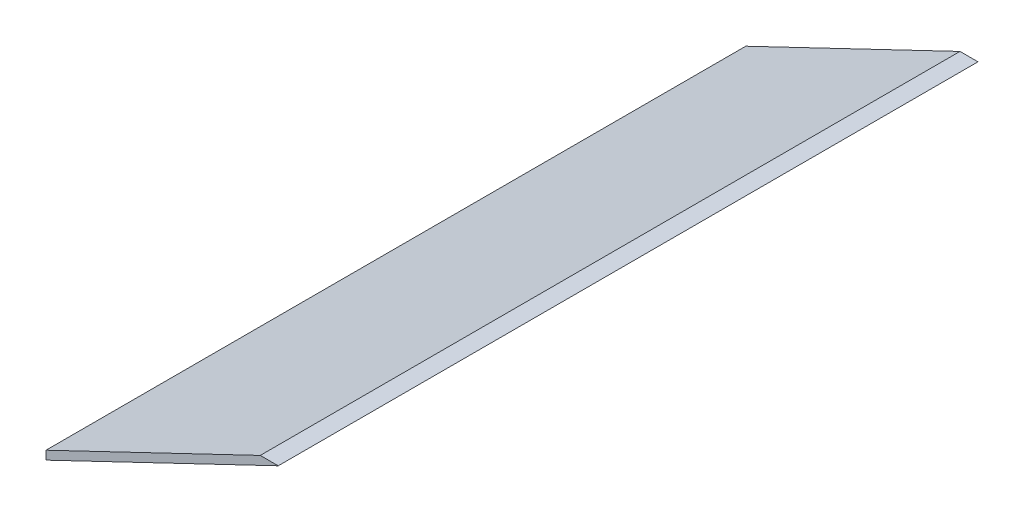
ISO-10303-21;
HEADER;
FILE_DESCRIPTION(('STEP AP214'),'2;1');
FILE_NAME('part.step','',(''),(''),'','','');
FILE_SCHEMA(('AUTOMOTIVE_DESIGN { 1 0 10303 214 1 1 1 1 }'));
ENDSEC;
DATA;
#1=APPLICATION_CONTEXT('core data for automotive mechanical design processes');
#2=APPLICATION_PROTOCOL_DEFINITION('international standard','automotive_design',2000,#1);
#3=PRODUCT_CONTEXT('',#1,'mechanical');
#4=PRODUCT('Part','Part','',(#3));
#5=PRODUCT_RELATED_PRODUCT_CATEGORY('part','',(#4));
#6=PRODUCT_DEFINITION_FORMATION('','',#4);
#7=PRODUCT_DEFINITION_CONTEXT('part definition',#1,'design');
#8=PRODUCT_DEFINITION('design','',#6,#7);
#9=PRODUCT_DEFINITION_SHAPE('','',#8);
#10=(LENGTH_UNIT() NAMED_UNIT(*) SI_UNIT(.MILLI.,.METRE.));
#11=(NAMED_UNIT(*) PLANE_ANGLE_UNIT() SI_UNIT($,.RADIAN.));
#12=(NAMED_UNIT(*) SI_UNIT($,.STERADIAN.) SOLID_ANGLE_UNIT());
#13=UNCERTAINTY_MEASURE_WITH_UNIT(LENGTH_MEASURE(1.E-05),#10,'distance_accuracy_value','');
#14=(GEOMETRIC_REPRESENTATION_CONTEXT(3) GLOBAL_UNCERTAINTY_ASSIGNED_CONTEXT((#13)) GLOBAL_UNIT_ASSIGNED_CONTEXT((#10,
#11,#12)) REPRESENTATION_CONTEXT('',''));
#15=CARTESIAN_POINT('',(0.,0.,0.));
#16=DIRECTION('',(0.,0.,1.));
#17=DIRECTION('',(1.,0.,0.));
#18=AXIS2_PLACEMENT_3D('',#15,#16,#17);
#19=CARTESIAN_POINT('',(97.5,182.5,450.));
#20=DIRECTION('',(-0.431904937574063,0.901919134345837,0.));
#21=DIRECTION('',(-0.901919134345837,-0.431904937574063,0.));
#22=AXIS2_PLACEMENT_3D('',#19,#20,#21);
#23=PLANE('',#22);
#24=DIRECTION('',(0.901919134345837,0.431904937574063,0.));
#25=VECTOR('',#24,1.);
#26=CARTESIAN_POINT('',(97.5,182.5,0.));
#27=LINE('',#26,#25);
#28=CARTESIAN_POINT('',(97.5,182.5,0.));
#29=VERTEX_POINT('',#28);
#30=CARTESIAN_POINT('',(246.858259493534,254.023673560284,0.));
#31=VERTEX_POINT('',#30);
#32=EDGE_CURVE('E96',#29,#31,#27,.T.);
#33=ORIENTED_EDGE('',*,*,#32,.T.);
#34=DIRECTION('',(0.,0.,-1.));
#35=VECTOR('',#34,1.);
#36=CARTESIAN_POINT('',(246.858259493534,254.023673560284,450.));
#37=LINE('',#36,#35);
#38=CARTESIAN_POINT('',(246.858259493534,254.023673560284,450.));
#39=VERTEX_POINT('',#38);
#40=EDGE_CURVE('E11',#39,#31,#37,.T.);
#41=ORIENTED_EDGE('',*,*,#40,.F.);
#42=DIRECTION('',(0.901919134345837,0.431904937574063,0.));
#43=VECTOR('',#42,1.);
#44=CARTESIAN_POINT('',(97.5,182.5,450.));
#45=LINE('',#44,#43);
#46=CARTESIAN_POINT('',(97.5,182.5,450.));
#47=VERTEX_POINT('',#46);
#48=EDGE_CURVE('E84',#47,#39,#45,.T.);
#49=ORIENTED_EDGE('',*,*,#48,.F.);
#50=DIRECTION('',(0.,0.,-1.));
#51=VECTOR('',#50,1.);
#52=CARTESIAN_POINT('',(97.5,182.5,450.));
#53=LINE('',#52,#51);
#54=EDGE_CURVE('E92',#47,#29,#53,.T.);
#55=ORIENTED_EDGE('',*,*,#54,.T.);
#56=EDGE_LOOP('',(#33,#41,#49,#55));
#57=FACE_BOUND('',#56,.T.);
#58=ADVANCED_FACE('F33',(#57),#23,.F.);
#59=CARTESIAN_POINT('',(235.281637961758,254.023673560284,450.));
#60=DIRECTION('',(0.,-1.,0.));
#61=DIRECTION('',(0.,0.,-1.));
#62=AXIS2_PLACEMENT_3D('',#59,#60,#61);
#63=PLANE('',#62);
#64=DIRECTION('',(-1.,0.,0.));
#65=VECTOR('',#64,1.);
#66=CARTESIAN_POINT('',(235.281637961758,254.023673560284,0.));
#67=LINE('',#66,#65);
#68=CARTESIAN_POINT('',(235.281637961758,254.023673560284,0.));
#69=VERTEX_POINT('',#68);
#70=EDGE_CURVE('E88',#31,#69,#67,.T.);
#71=ORIENTED_EDGE('',*,*,#70,.T.);
#72=DIRECTION('',(0.,0.,-1.));
#73=VECTOR('',#72,1.);
#74=CARTESIAN_POINT('',(235.281637961758,254.023673560284,450.));
#75=LINE('',#74,#73);
#76=CARTESIAN_POINT('',(235.281637961758,254.023673560284,450.));
#77=VERTEX_POINT('',#76);
#78=EDGE_CURVE('E41',#77,#69,#75,.T.);
#79=ORIENTED_EDGE('',*,*,#78,.F.);
#80=DIRECTION('',(-1.,0.,0.));
#81=VECTOR('',#80,1.);
#82=CARTESIAN_POINT('',(235.281637961758,254.023673560284,450.));
#83=LINE('',#82,#81);
#84=EDGE_CURVE('E79',#39,#77,#83,.T.);
#85=ORIENTED_EDGE('',*,*,#84,.F.);
#86=ORIENTED_EDGE('',*,*,#40,.T.);
#87=EDGE_LOOP('',(#71,#79,#85,#86));
#88=FACE_BOUND('',#87,.T.);
#89=ADVANCED_FACE('F87',(#88),#63,.F.);
#90=CARTESIAN_POINT('',(97.5,188.043734254653,450.));
#91=DIRECTION('',(0.431904937574063,-0.901919134345837,0.));
#92=DIRECTION('',(0.901919134345838,0.431904937574063,0.));
#93=AXIS2_PLACEMENT_3D('',#90,#91,#92);
#94=PLANE('',#93);
#95=DIRECTION('',(-0.901919134345837,-0.431904937574063,0.));
#96=VECTOR('',#95,1.);
#97=CARTESIAN_POINT('',(97.5,188.043734254653,0.));
#98=LINE('',#97,#96);
#99=CARTESIAN_POINT('',(97.5,188.043734254653,0.));
#100=VERTEX_POINT('',#99);
#101=EDGE_CURVE('E66',#69,#100,#98,.T.);
#102=ORIENTED_EDGE('',*,*,#101,.T.);
#103=DIRECTION('',(0.,0.,-1.));
#104=VECTOR('',#103,1.);
#105=CARTESIAN_POINT('',(97.5,188.043734254653,450.));
#106=LINE('',#105,#104);
#107=CARTESIAN_POINT('',(97.5,188.043734254653,450.));
#108=VERTEX_POINT('',#107);
#109=EDGE_CURVE('E89',#108,#100,#106,.T.);
#110=ORIENTED_EDGE('',*,*,#109,.F.);
#111=DIRECTION('',(-0.901919134345837,-0.431904937574063,0.));
#112=VECTOR('',#111,1.);
#113=CARTESIAN_POINT('',(97.5,188.043734254653,450.));
#114=LINE('',#113,#112);
#115=EDGE_CURVE('E82',#77,#108,#114,.T.);
#116=ORIENTED_EDGE('',*,*,#115,.F.);
#117=ORIENTED_EDGE('',*,*,#78,.T.);
#118=EDGE_LOOP('',(#102,#110,#116,#117));
#119=FACE_BOUND('',#118,.T.);
#120=ADVANCED_FACE('F90',(#119),#94,.F.);
#121=CARTESIAN_POINT('',(97.5,188.043734254653,450.));
#122=DIRECTION('',(1.,0.,0.));
#123=DIRECTION('',(0.,1.,0.));
#124=AXIS2_PLACEMENT_3D('',#121,#122,#123);
#125=PLANE('',#124);
#126=DIRECTION('',(0.,-1.,0.));
#127=VECTOR('',#126,1.);
#128=CARTESIAN_POINT('',(97.5,188.043734254653,0.));
#129=LINE('',#128,#127);
#130=EDGE_CURVE('E72',#100,#29,#129,.T.);
#131=ORIENTED_EDGE('',*,*,#130,.T.);
#132=ORIENTED_EDGE('',*,*,#54,.F.);
#133=DIRECTION('',(0.,-1.,0.));
#134=VECTOR('',#133,1.);
#135=CARTESIAN_POINT('',(97.5,188.043734254653,450.));
#136=LINE('',#135,#134);
#137=EDGE_CURVE('E49',#108,#47,#136,.T.);
#138=ORIENTED_EDGE('',*,*,#137,.F.);
#139=ORIENTED_EDGE('',*,*,#109,.T.);
#140=EDGE_LOOP('',(#131,#132,#138,#139));
#141=FACE_BOUND('',#140,.T.);
#142=ADVANCED_FACE('F103',(#141),#125,.F.);
#143=CARTESIAN_POINT('',(0.,0.,450.));
#144=DIRECTION('',(0.,0.,-1.));
#145=DIRECTION('',(-1.,0.,0.));
#146=AXIS2_PLACEMENT_3D('',#143,#144,#145);
#147=PLANE('',#146);
#148=ORIENTED_EDGE('',*,*,#48,.T.);
#149=ORIENTED_EDGE('',*,*,#84,.T.);
#150=ORIENTED_EDGE('',*,*,#115,.T.);
#151=ORIENTED_EDGE('',*,*,#137,.T.);
#152=EDGE_LOOP('',(#148,#149,#150,#151));
#153=FACE_BOUND('',#152,.T.);
#154=ADVANCED_FACE('F80',(#153),#147,.F.);
#155=CARTESIAN_POINT('',(0.,0.,0.));
#156=DIRECTION('',(0.,0.,-1.));
#157=DIRECTION('',(-1.,0.,0.));
#158=AXIS2_PLACEMENT_3D('',#155,#156,#157);
#159=PLANE('',#158);
#160=ORIENTED_EDGE('',*,*,#32,.F.);
#161=ORIENTED_EDGE('',*,*,#130,.F.);
#162=ORIENTED_EDGE('',*,*,#101,.F.);
#163=ORIENTED_EDGE('',*,*,#70,.F.);
#164=EDGE_LOOP('',(#160,#161,#162,#163));
#165=FACE_BOUND('',#164,.T.);
#166=ADVANCED_FACE('F106',(#165),#159,.T.);
#167=CLOSED_SHELL('',(#58,#89,#120,#142,#154,#166));
#168=MANIFOLD_SOLID_BREP('B2',#167);
#169=ADVANCED_BREP_SHAPE_REPRESENTATION('',(#18,#168),#14);
#170=SHAPE_DEFINITION_REPRESENTATION(#9,#169);
ENDSEC;
END-ISO-10303-21;
